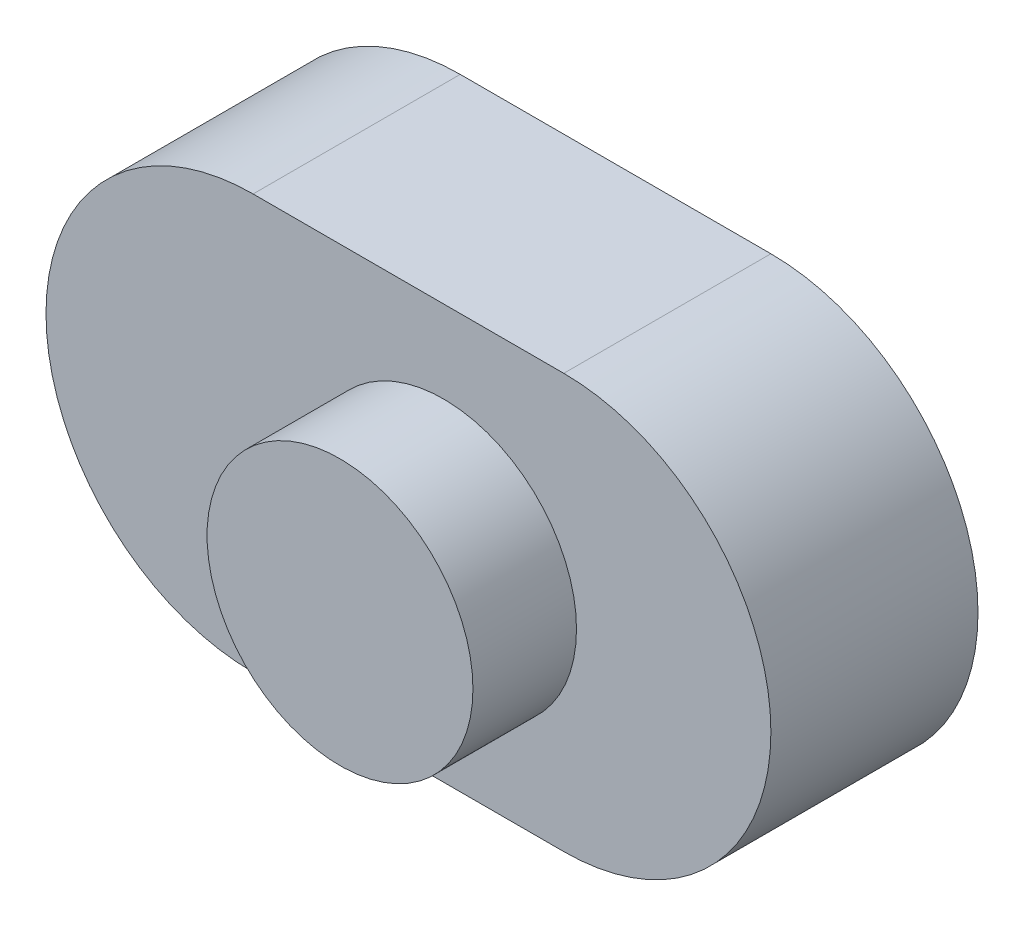
ISO-10303-21;
HEADER;
FILE_DESCRIPTION(('STEP AP214'),'2;1');
FILE_NAME('part.step','',(''),(''),'','','');
FILE_SCHEMA(('AUTOMOTIVE_DESIGN { 1 0 10303 214 1 1 1 1 }'));
ENDSEC;
DATA;
#1=APPLICATION_CONTEXT('core data for automotive mechanical design processes');
#2=APPLICATION_PROTOCOL_DEFINITION('international standard','automotive_design',2000,#1);
#3=PRODUCT_CONTEXT('',#1,'mechanical');
#4=PRODUCT('Part','Part','',(#3));
#5=PRODUCT_RELATED_PRODUCT_CATEGORY('part','',(#4));
#6=PRODUCT_DEFINITION_FORMATION('','',#4);
#7=PRODUCT_DEFINITION_CONTEXT('part definition',#1,'design');
#8=PRODUCT_DEFINITION('design','',#6,#7);
#9=PRODUCT_DEFINITION_SHAPE('','',#8);
#10=(LENGTH_UNIT() NAMED_UNIT(*) SI_UNIT(.MILLI.,.METRE.));
#11=(NAMED_UNIT(*) PLANE_ANGLE_UNIT() SI_UNIT($,.RADIAN.));
#12=(NAMED_UNIT(*) SI_UNIT($,.STERADIAN.) SOLID_ANGLE_UNIT());
#13=UNCERTAINTY_MEASURE_WITH_UNIT(LENGTH_MEASURE(1.E-05),#10,'distance_accuracy_value','');
#14=(GEOMETRIC_REPRESENTATION_CONTEXT(3) GLOBAL_UNCERTAINTY_ASSIGNED_CONTEXT((#13)) GLOBAL_UNIT_ASSIGNED_CONTEXT((#10,
#11,#12)) REPRESENTATION_CONTEXT('',''));
#15=CARTESIAN_POINT('',(0.,0.,0.));
#16=DIRECTION('',(0.,0.,1.));
#17=DIRECTION('',(1.,0.,0.));
#18=AXIS2_PLACEMENT_3D('',#15,#16,#17);
#19=CARTESIAN_POINT('',(-55.369792260911,-2.50694330320461,10.));
#20=DIRECTION('',(0.,0.,1.));
#21=DIRECTION('',(1.,0.,0.));
#22=AXIS2_PLACEMENT_3D('',#19,#20,#21);
#23=PLANE('',#22);
#24=CARTESIAN_POINT('',(-55.369792260911,-2.50694330320461,10.));
#25=DIRECTION('',(0.,0.,1.));
#26=DIRECTION('',(1.,0.,0.));
#27=AXIS2_PLACEMENT_3D('',#24,#25,#26);
#28=CIRCLE('',#27,10.);
#29=CARTESIAN_POINT('',(-55.369792260911,7.4930566967954,10.));
#30=VERTEX_POINT('',#29);
#31=CARTESIAN_POINT('',(-55.369792260911,-12.5069433032046,10.));
#32=VERTEX_POINT('',#31);
#33=EDGE_CURVE('E85',#30,#32,#28,.T.);
#34=ORIENTED_EDGE('',*,*,#33,.T.);
#35=DIRECTION('',(1.,0.,0.));
#36=VECTOR('',#35,1.);
#37=CARTESIAN_POINT('',(-55.369792260911,-12.5069433032046,10.));
#38=LINE('',#37,#36);
#39=CARTESIAN_POINT('',(-40.369792260911,-12.5069433032046,10.));
#40=VERTEX_POINT('',#39);
#41=EDGE_CURVE('E80',#32,#40,#38,.T.);
#42=ORIENTED_EDGE('',*,*,#41,.T.);
#43=CARTESIAN_POINT('',(-40.369792260911,-2.50694330320461,10.));
#44=DIRECTION('',(0.,0.,1.));
#45=DIRECTION('',(1.,0.,0.));
#46=AXIS2_PLACEMENT_3D('',#43,#44,#45);
#47=CIRCLE('',#46,10.);
#48=CARTESIAN_POINT('',(-40.369792260911,7.49305669679539,10.));
#49=VERTEX_POINT('',#48);
#50=EDGE_CURVE('E83',#40,#49,#47,.T.);
#51=ORIENTED_EDGE('',*,*,#50,.T.);
#52=DIRECTION('',(-1.,0.,0.));
#53=VECTOR('',#52,1.);
#54=CARTESIAN_POINT('',(-55.369792260911,7.4930566967954,10.));
#55=LINE('',#54,#53);
#56=EDGE_CURVE('E50',#49,#30,#55,.T.);
#57=ORIENTED_EDGE('',*,*,#56,.T.);
#58=EDGE_LOOP('',(#34,#42,#51,#57));
#59=FACE_BOUND('',#58,.T.);
#60=CARTESIAN_POINT('',(-46.1745369743767,-2.89790969156911,10.));
#61=DIRECTION('',(0.,0.,1.));
#62=DIRECTION('',(1.,0.,0.));
#63=AXIS2_PLACEMENT_3D('',#60,#61,#62);
#64=CIRCLE('',#63,6.41860516374305);
#65=CARTESIAN_POINT('',(-39.7559318106336,-2.89790969156911,10.));
#66=VERTEX_POINT('',#65);
#67=EDGE_CURVE('E111',#66,#66,#64,.T.);
#68=ORIENTED_EDGE('',*,*,#67,.F.);
#69=EDGE_LOOP('',(#68));
#70=FACE_BOUND('',#69,.T.);
#71=ADVANCED_FACE('F33',(#59,#70),#23,.T.);
#72=CARTESIAN_POINT('',(-55.369792260911,-2.50694330320461,10.));
#73=DIRECTION('',(0.,0.,-1.));
#74=DIRECTION('',(-1.,0.,0.));
#75=AXIS2_PLACEMENT_3D('',#72,#73,#74);
#76=CYLINDRICAL_SURFACE('',#75,10.);
#77=CARTESIAN_POINT('',(-55.369792260911,-2.50694330320461,0.));
#78=DIRECTION('',(0.,0.,1.));
#79=DIRECTION('',(1.,0.,0.));
#80=AXIS2_PLACEMENT_3D('',#77,#78,#79);
#81=CIRCLE('',#80,10.);
#82=CARTESIAN_POINT('',(-55.369792260911,7.4930566967954,0.));
#83=VERTEX_POINT('',#82);
#84=CARTESIAN_POINT('',(-55.369792260911,-12.5069433032046,0.));
#85=VERTEX_POINT('',#84);
#86=EDGE_CURVE('E97',#83,#85,#81,.T.);
#87=ORIENTED_EDGE('',*,*,#86,.T.);
#88=DIRECTION('',(0.,0.,-1.));
#89=VECTOR('',#88,1.);
#90=CARTESIAN_POINT('',(-55.369792260911,-12.5069433032046,10.));
#91=LINE('',#90,#89);
#92=EDGE_CURVE('E11',#32,#85,#91,.T.);
#93=ORIENTED_EDGE('',*,*,#92,.F.);
#94=ORIENTED_EDGE('',*,*,#33,.F.);
#95=DIRECTION('',(0.,0.,-1.));
#96=VECTOR('',#95,1.);
#97=CARTESIAN_POINT('',(-55.369792260911,7.4930566967954,10.));
#98=LINE('',#97,#96);
#99=EDGE_CURVE('E93',#30,#83,#98,.T.);
#100=ORIENTED_EDGE('',*,*,#99,.T.);
#101=EDGE_LOOP('',(#87,#93,#94,#100));
#102=FACE_BOUND('',#101,.T.);
#103=ADVANCED_FACE('F35',(#102),#76,.T.);
#104=CARTESIAN_POINT('',(-55.369792260911,-12.5069433032046,10.));
#105=DIRECTION('',(0.,1.,0.));
#106=DIRECTION('',(0.,0.,1.));
#107=AXIS2_PLACEMENT_3D('',#104,#105,#106);
#108=PLANE('',#107);
#109=DIRECTION('',(1.,0.,0.));
#110=VECTOR('',#109,1.);
#111=CARTESIAN_POINT('',(-55.369792260911,-12.5069433032046,0.));
#112=LINE('',#111,#110);
#113=CARTESIAN_POINT('',(-40.369792260911,-12.5069433032046,0.));
#114=VERTEX_POINT('',#113);
#115=EDGE_CURVE('E89',#85,#114,#112,.T.);
#116=ORIENTED_EDGE('',*,*,#115,.T.);
#117=DIRECTION('',(0.,0.,-1.));
#118=VECTOR('',#117,1.);
#119=CARTESIAN_POINT('',(-40.369792260911,-12.5069433032046,10.));
#120=LINE('',#119,#118);
#121=EDGE_CURVE('E42',#40,#114,#120,.T.);
#122=ORIENTED_EDGE('',*,*,#121,.F.);
#123=ORIENTED_EDGE('',*,*,#41,.F.);
#124=ORIENTED_EDGE('',*,*,#92,.T.);
#125=EDGE_LOOP('',(#116,#122,#123,#124));
#126=FACE_BOUND('',#125,.T.);
#127=ADVANCED_FACE('F88',(#126),#108,.F.);
#128=CARTESIAN_POINT('',(-40.369792260911,-2.50694330320461,10.));
#129=DIRECTION('',(0.,0.,-1.));
#130=DIRECTION('',(-1.,0.,0.));
#131=AXIS2_PLACEMENT_3D('',#128,#129,#130);
#132=CYLINDRICAL_SURFACE('',#131,10.);
#133=CARTESIAN_POINT('',(-40.369792260911,-2.50694330320461,0.));
#134=DIRECTION('',(0.,0.,1.));
#135=DIRECTION('',(1.,0.,0.));
#136=AXIS2_PLACEMENT_3D('',#133,#134,#135);
#137=CIRCLE('',#136,10.);
#138=CARTESIAN_POINT('',(-40.369792260911,7.49305669679539,0.));
#139=VERTEX_POINT('',#138);
#140=EDGE_CURVE('E67',#114,#139,#137,.T.);
#141=ORIENTED_EDGE('',*,*,#140,.T.);
#142=DIRECTION('',(0.,0.,-1.));
#143=VECTOR('',#142,1.);
#144=CARTESIAN_POINT('',(-40.369792260911,7.49305669679539,10.));
#145=LINE('',#144,#143);
#146=EDGE_CURVE('E90',#49,#139,#145,.T.);
#147=ORIENTED_EDGE('',*,*,#146,.F.);
#148=ORIENTED_EDGE('',*,*,#50,.F.);
#149=ORIENTED_EDGE('',*,*,#121,.T.);
#150=EDGE_LOOP('',(#141,#147,#148,#149));
#151=FACE_BOUND('',#150,.T.);
#152=ADVANCED_FACE('F91',(#151),#132,.T.);
#153=CARTESIAN_POINT('',(-55.369792260911,7.4930566967954,10.));
#154=DIRECTION('',(0.,-1.,0.));
#155=DIRECTION('',(1.,0.,0.));
#156=AXIS2_PLACEMENT_3D('',#153,#154,#155);
#157=PLANE('',#156);
#158=DIRECTION('',(-1.,0.,0.));
#159=VECTOR('',#158,1.);
#160=CARTESIAN_POINT('',(-55.369792260911,7.4930566967954,0.));
#161=LINE('',#160,#159);
#162=EDGE_CURVE('E73',#139,#83,#161,.T.);
#163=ORIENTED_EDGE('',*,*,#162,.T.);
#164=ORIENTED_EDGE('',*,*,#99,.F.);
#165=ORIENTED_EDGE('',*,*,#56,.F.);
#166=ORIENTED_EDGE('',*,*,#146,.T.);
#167=EDGE_LOOP('',(#163,#164,#165,#166));
#168=FACE_BOUND('',#167,.T.);
#169=ADVANCED_FACE('F105',(#168),#157,.F.);
#170=CARTESIAN_POINT('',(-55.369792260911,-2.50694330320461,0.));
#171=DIRECTION('',(0.,0.,1.));
#172=DIRECTION('',(1.,0.,0.));
#173=AXIS2_PLACEMENT_3D('',#170,#171,#172);
#174=PLANE('',#173);
#175=ORIENTED_EDGE('',*,*,#86,.F.);
#176=ORIENTED_EDGE('',*,*,#162,.F.);
#177=ORIENTED_EDGE('',*,*,#140,.F.);
#178=ORIENTED_EDGE('',*,*,#115,.F.);
#179=EDGE_LOOP('',(#175,#176,#177,#178));
#180=FACE_BOUND('',#179,.T.);
#181=ADVANCED_FACE('F108',(#180),#174,.F.);
#182=CARTESIAN_POINT('',(-46.1745369743767,-2.89790969156911,15.));
#183=DIRECTION('',(0.,0.,-1.));
#184=DIRECTION('',(-1.,0.,0.));
#185=AXIS2_PLACEMENT_3D('',#182,#183,#184);
#186=CYLINDRICAL_SURFACE('',#185,6.41860516374305);
#187=CARTESIAN_POINT('',(-46.1745369743767,-2.89790969156911,15.));
#188=DIRECTION('',(0.,0.,1.));
#189=DIRECTION('',(1.,0.,0.));
#190=AXIS2_PLACEMENT_3D('',#187,#188,#189);
#191=CIRCLE('',#190,6.41860516374305);
#192=CARTESIAN_POINT('',(-39.7559318106336,-2.89790969156911,15.));
#193=VERTEX_POINT('',#192);
#194=EDGE_CURVE('E100',#193,#193,#191,.T.);
#195=ORIENTED_EDGE('',*,*,#194,.F.);
#196=EDGE_LOOP('',(#195));
#197=FACE_BOUND('',#196,.T.);
#198=ORIENTED_EDGE('',*,*,#67,.T.);
#199=EDGE_LOOP('',(#198));
#200=FACE_BOUND('',#199,.T.);
#201=ADVANCED_FACE('F119',(#197,#200),#186,.T.);
#202=CARTESIAN_POINT('',(-46.1745369743767,-2.89790969156911,15.));
#203=DIRECTION('',(0.,0.,1.));
#204=DIRECTION('',(1.,0.,0.));
#205=AXIS2_PLACEMENT_3D('',#202,#203,#204);
#206=PLANE('',#205);
#207=ORIENTED_EDGE('',*,*,#194,.T.);
#208=EDGE_LOOP('',(#207));
#209=FACE_BOUND('',#208,.T.);
#210=ADVANCED_FACE('F117',(#209),#206,.T.);
#211=CLOSED_SHELL('',(#71,#103,#127,#152,#169,#181,#201,#210));
#212=MANIFOLD_SOLID_BREP('B2',#211);
#213=ADVANCED_BREP_SHAPE_REPRESENTATION('',(#18,#212),#14);
#214=SHAPE_DEFINITION_REPRESENTATION(#9,#213);
ENDSEC;
END-ISO-10303-21;
